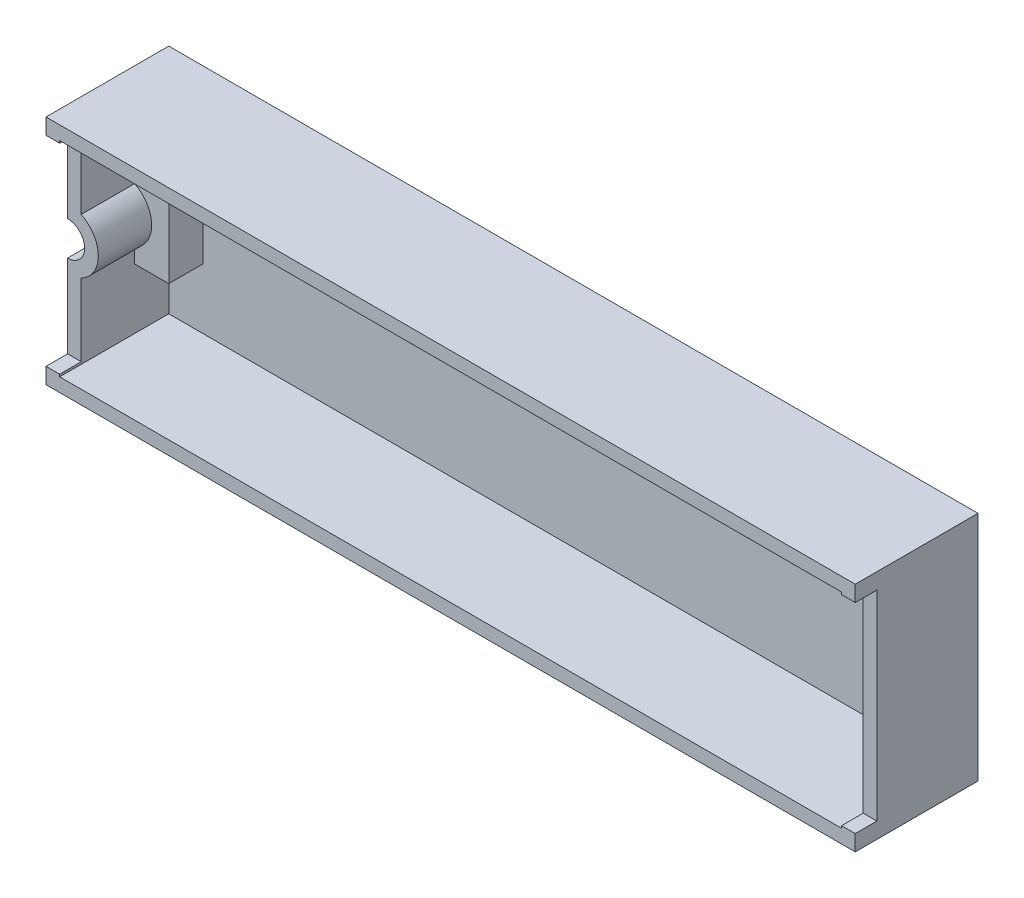
ISO-10303-21;
HEADER;
FILE_DESCRIPTION(('STEP AP214'),'2;1');
FILE_NAME('part.step','',(''),(''),'','','');
FILE_SCHEMA(('AUTOMOTIVE_DESIGN { 1 0 10303 214 1 1 1 1 }'));
ENDSEC;
DATA;
#1=APPLICATION_CONTEXT('core data for automotive mechanical design processes');
#2=APPLICATION_PROTOCOL_DEFINITION('international standard','automotive_design',2000,#1);
#3=PRODUCT_CONTEXT('',#1,'mechanical');
#4=PRODUCT('Part','Part','',(#3));
#5=PRODUCT_RELATED_PRODUCT_CATEGORY('part','',(#4));
#6=PRODUCT_DEFINITION_FORMATION('','',#4);
#7=PRODUCT_DEFINITION_CONTEXT('part definition',#1,'design');
#8=PRODUCT_DEFINITION('design','',#6,#7);
#9=PRODUCT_DEFINITION_SHAPE('','',#8);
#10=(LENGTH_UNIT() NAMED_UNIT(*) SI_UNIT(.MILLI.,.METRE.));
#11=(NAMED_UNIT(*) PLANE_ANGLE_UNIT() SI_UNIT($,.RADIAN.));
#12=(NAMED_UNIT(*) SI_UNIT($,.STERADIAN.) SOLID_ANGLE_UNIT());
#13=UNCERTAINTY_MEASURE_WITH_UNIT(LENGTH_MEASURE(1.E-05),#10,'distance_accuracy_value','');
#14=(GEOMETRIC_REPRESENTATION_CONTEXT(3) GLOBAL_UNCERTAINTY_ASSIGNED_CONTEXT((#13)) GLOBAL_UNIT_ASSIGNED_CONTEXT((#10,
#11,#12)) REPRESENTATION_CONTEXT('',''));
#15=CARTESIAN_POINT('',(0.,0.,0.));
#16=DIRECTION('',(0.,0.,1.));
#17=DIRECTION('',(1.,0.,0.));
#18=AXIS2_PLACEMENT_3D('',#15,#16,#17);
#19=CARTESIAN_POINT('',(-15.7,-1.25,0.));
#20=DIRECTION('',(1.,0.,0.));
#21=DIRECTION('',(0.,0.,-1.));
#22=AXIS2_PLACEMENT_3D('',#19,#20,#21);
#23=PLANE('',#22);
#24=DIRECTION('',(0.,1.,0.));
#25=VECTOR('',#24,1.);
#26=CARTESIAN_POINT('',(-15.7,0.,2.1));
#27=LINE('',#26,#25);
#28=CARTESIAN_POINT('',(-15.7,-1.85,2.1));
#29=VERTEX_POINT('',#28);
#30=CARTESIAN_POINT('',(-15.7,1.85,2.1));
#31=VERTEX_POINT('',#30);
#32=EDGE_CURVE('E269',#29,#31,#27,.T.);
#33=ORIENTED_EDGE('',*,*,#32,.F.);
#34=DIRECTION('',(0.,0.,-1.));
#35=VECTOR('',#34,1.);
#36=CARTESIAN_POINT('',(-15.7,-1.85,0.));
#37=LINE('',#36,#35);
#38=CARTESIAN_POINT('',(-15.7,-1.85,0.6));
#39=VERTEX_POINT('',#38);
#40=EDGE_CURVE('E272',#39,#29,#37,.F.);
#41=ORIENTED_EDGE('',*,*,#40,.F.);
#42=DIRECTION('',(0.,1.,0.));
#43=VECTOR('',#42,1.);
#44=CARTESIAN_POINT('',(-15.7,0.,0.6));
#45=LINE('',#44,#43);
#46=CARTESIAN_POINT('',(-15.7,1.85,0.6));
#47=VERTEX_POINT('',#46);
#48=EDGE_CURVE('E266',#47,#39,#45,.F.);
#49=ORIENTED_EDGE('',*,*,#48,.F.);
#50=DIRECTION('',(0.,0.,1.));
#51=VECTOR('',#50,1.);
#52=CARTESIAN_POINT('',(-15.7,1.85,0.));
#53=LINE('',#52,#51);
#54=EDGE_CURVE('E270',#31,#47,#53,.F.);
#55=ORIENTED_EDGE('',*,*,#54,.F.);
#56=EDGE_LOOP('',(#33,#41,#49,#55));
#57=FACE_BOUND('',#56,.T.);
#58=ADVANCED_FACE('F16',(#57),#23,.T.);
#59=CARTESIAN_POINT('',(-16.3,1.85,0.));
#60=DIRECTION('',(0.,1.,0.));
#61=DIRECTION('',(0.,0.,1.));
#62=AXIS2_PLACEMENT_3D('',#59,#60,#61);
#63=PLANE('',#62);
#64=DIRECTION('',(1.,0.,0.));
#65=VECTOR('',#64,1.);
#66=CARTESIAN_POINT('',(-17.05,1.85,2.1));
#67=LINE('',#66,#65);
#68=CARTESIAN_POINT('',(-17.2,1.85,2.1));
#69=VERTEX_POINT('',#68);
#70=EDGE_CURVE('E214',#31,#69,#67,.F.);
#71=ORIENTED_EDGE('',*,*,#70,.F.);
#72=ORIENTED_EDGE('',*,*,#54,.T.);
#73=DIRECTION('',(1.,0.,0.));
#74=VECTOR('',#73,1.);
#75=CARTESIAN_POINT('',(-0.042575970452277,1.85,0.6));
#76=LINE('',#75,#74);
#77=CARTESIAN_POINT('',(-17.2,1.85,0.6));
#78=VERTEX_POINT('',#77);
#79=EDGE_CURVE('E277',#78,#47,#76,.T.);
#80=ORIENTED_EDGE('',*,*,#79,.F.);
#81=DIRECTION('',(0.,0.,1.));
#82=VECTOR('',#81,1.);
#83=CARTESIAN_POINT('',(-17.2,1.85,0.));
#84=LINE('',#83,#82);
#85=EDGE_CURVE('E218',#78,#69,#84,.T.);
#86=ORIENTED_EDGE('',*,*,#85,.T.);
#87=EDGE_LOOP('',(#71,#72,#80,#86));
#88=FACE_BOUND('',#87,.T.);
#89=ADVANCED_FACE('F547',(#88),#63,.T.);
#90=CARTESIAN_POINT('',(-17.05,0.,2.1));
#91=DIRECTION('',(0.,0.,1.));
#92=DIRECTION('',(1.,0.,0.));
#93=AXIS2_PLACEMENT_3D('',#90,#91,#92);
#94=PLANE('',#93);
#95=ORIENTED_EDGE('',*,*,#70,.T.);
#96=DIRECTION('',(0.,1.,0.));
#97=VECTOR('',#96,1.);
#98=CARTESIAN_POINT('',(-17.2,5.1,2.1));
#99=LINE('',#98,#97);
#100=CARTESIAN_POINT('',(-17.2,1.20933866224478,2.1));
#101=VERTEX_POINT('',#100);
#102=EDGE_CURVE('E210',#69,#101,#99,.F.);
#103=ORIENTED_EDGE('',*,*,#102,.T.);
#104=CARTESIAN_POINT('',(-17.8,0.,2.1));
#105=DIRECTION('',(0.,0.,1.));
#106=DIRECTION('',(1.,0.,0.));
#107=AXIS2_PLACEMENT_3D('',#104,#105,#106);
#108=CIRCLE('',#107,1.35);
#109=CARTESIAN_POINT('',(-17.2,-1.20933866224478,2.1));
#110=VERTEX_POINT('',#109);
#111=EDGE_CURVE('E19',#110,#101,#108,.T.);
#112=ORIENTED_EDGE('',*,*,#111,.F.);
#113=DIRECTION('',(0.,1.,0.));
#114=VECTOR('',#113,1.);
#115=CARTESIAN_POINT('',(-17.2,0.,2.1));
#116=LINE('',#115,#114);
#117=CARTESIAN_POINT('',(-17.2,-1.85,2.1));
#118=VERTEX_POINT('',#117);
#119=EDGE_CURVE('E197',#110,#118,#116,.F.);
#120=ORIENTED_EDGE('',*,*,#119,.T.);
#121=DIRECTION('',(1.,0.,0.));
#122=VECTOR('',#121,1.);
#123=CARTESIAN_POINT('',(-17.8,-1.85,2.1));
#124=LINE('',#123,#122);
#125=EDGE_CURVE('E280',#29,#118,#124,.F.);
#126=ORIENTED_EDGE('',*,*,#125,.F.);
#127=ORIENTED_EDGE('',*,*,#32,.T.);
#128=EDGE_LOOP('',(#95,#103,#112,#120,#126,#127));
#129=FACE_BOUND('',#128,.T.);
#130=ADVANCED_FACE('F212',(#129),#94,.T.);
#131=CARTESIAN_POINT('',(-17.8,-1.85,0.));
#132=DIRECTION('',(0.,-1.,0.));
#133=DIRECTION('',(0.,0.,-1.));
#134=AXIS2_PLACEMENT_3D('',#131,#132,#133);
#135=PLANE('',#134);
#136=ORIENTED_EDGE('',*,*,#125,.T.);
#137=DIRECTION('',(0.,0.,1.));
#138=VECTOR('',#137,1.);
#139=CARTESIAN_POINT('',(-17.2,-1.85,0.));
#140=LINE('',#139,#138);
#141=CARTESIAN_POINT('',(-17.2,-1.85,0.6));
#142=VERTEX_POINT('',#141);
#143=EDGE_CURVE('E225',#118,#142,#140,.F.);
#144=ORIENTED_EDGE('',*,*,#143,.T.);
#145=DIRECTION('',(1.,0.,0.));
#146=VECTOR('',#145,1.);
#147=CARTESIAN_POINT('',(-0.042575970452277,-1.85,0.6));
#148=LINE('',#147,#146);
#149=EDGE_CURVE('E264',#39,#142,#148,.F.);
#150=ORIENTED_EDGE('',*,*,#149,.F.);
#151=ORIENTED_EDGE('',*,*,#40,.T.);
#152=EDGE_LOOP('',(#136,#144,#150,#151));
#153=FACE_BOUND('',#152,.T.);
#154=ADVANCED_FACE('F541',(#153),#135,.T.);
#155=CARTESIAN_POINT('',(-0.042575970452277,0.,0.6));
#156=DIRECTION('',(0.,0.,1.));
#157=DIRECTION('',(1.,0.,0.));
#158=AXIS2_PLACEMENT_3D('',#155,#156,#157);
#159=PLANE('',#158);
#160=DIRECTION('',(1.,0.,0.));
#161=VECTOR('',#160,1.);
#162=CARTESIAN_POINT('',(17.8,4.5,0.6));
#163=LINE('',#162,#161);
#164=CARTESIAN_POINT('',(17.2,4.5,0.6));
#165=VERTEX_POINT('',#164);
#166=CARTESIAN_POINT('',(-17.2,4.5,0.6));
#167=VERTEX_POINT('',#166);
#168=EDGE_CURVE('E232',#165,#167,#163,.F.);
#169=ORIENTED_EDGE('',*,*,#168,.T.);
#170=DIRECTION('',(0.,1.,0.));
#171=VECTOR('',#170,1.);
#172=CARTESIAN_POINT('',(-17.2,5.1,0.6));
#173=LINE('',#172,#171);
#174=EDGE_CURVE('E274',#167,#78,#173,.F.);
#175=ORIENTED_EDGE('',*,*,#174,.T.);
#176=ORIENTED_EDGE('',*,*,#79,.T.);
#177=ORIENTED_EDGE('',*,*,#48,.T.);
#178=ORIENTED_EDGE('',*,*,#149,.T.);
#179=DIRECTION('',(0.,1.,0.));
#180=VECTOR('',#179,1.);
#181=CARTESIAN_POINT('',(-17.2,-0.75,0.6));
#182=LINE('',#181,#180);
#183=CARTESIAN_POINT('',(-17.2,-4.5,0.6));
#184=VERTEX_POINT('',#183);
#185=EDGE_CURVE('E322',#142,#184,#182,.F.);
#186=ORIENTED_EDGE('',*,*,#185,.T.);
#187=DIRECTION('',(1.,0.,0.));
#188=VECTOR('',#187,1.);
#189=CARTESIAN_POINT('',(-17.8,-4.5,0.6));
#190=LINE('',#189,#188);
#191=CARTESIAN_POINT('',(17.2,-4.5,0.6));
#192=VERTEX_POINT('',#191);
#193=EDGE_CURVE('E265',#184,#192,#190,.T.);
#194=ORIENTED_EDGE('',*,*,#193,.T.);
#195=DIRECTION('',(0.,1.,0.));
#196=VECTOR('',#195,1.);
#197=CARTESIAN_POINT('',(17.2,-5.1,0.6));
#198=LINE('',#197,#196);
#199=EDGE_CURVE('E301',#192,#165,#198,.T.);
#200=ORIENTED_EDGE('',*,*,#199,.T.);
#201=EDGE_LOOP('',(#169,#175,#176,#177,#178,#186,#194,#200));
#202=FACE_BOUND('',#201,.T.);
#203=ADVANCED_FACE('F537',(#202),#159,.T.);
#204=CARTESIAN_POINT('',(-17.8,-4.5,0.));
#205=DIRECTION('',(0.,-1.,0.));
#206=DIRECTION('',(0.,0.,-1.));
#207=AXIS2_PLACEMENT_3D('',#204,#205,#206);
#208=PLANE('',#207);
#209=DIRECTION('',(0.,0.,1.));
#210=VECTOR('',#209,1.);
#211=CARTESIAN_POINT('',(-17.2,-4.5,0.));
#212=LINE('',#211,#210);
#213=CARTESIAN_POINT('',(-17.2,-4.5,5.4));
#214=VERTEX_POINT('',#213);
#215=EDGE_CURVE('E319',#184,#214,#212,.T.);
#216=ORIENTED_EDGE('',*,*,#215,.T.);
#217=DIRECTION('',(1.,0.,0.));
#218=VECTOR('',#217,1.);
#219=CARTESIAN_POINT('',(-0.042575970452277,-4.5,5.4));
#220=LINE('',#219,#218);
#221=CARTESIAN_POINT('',(17.2,-4.5,5.4));
#222=VERTEX_POINT('',#221);
#223=EDGE_CURVE('E241',#222,#214,#220,.F.);
#224=ORIENTED_EDGE('',*,*,#223,.F.);
#225=DIRECTION('',(0.,0.,-1.));
#226=VECTOR('',#225,1.);
#227=CARTESIAN_POINT('',(17.2,-4.5,0.));
#228=LINE('',#227,#226);
#229=EDGE_CURVE('E303',#222,#192,#228,.T.);
#230=ORIENTED_EDGE('',*,*,#229,.T.);
#231=ORIENTED_EDGE('',*,*,#193,.F.);
#232=EDGE_LOOP('',(#216,#224,#230,#231));
#233=FACE_BOUND('',#232,.T.);
#234=ADVANCED_FACE('F533',(#233),#208,.F.);
#235=CARTESIAN_POINT('',(17.2,-5.1,0.));
#236=DIRECTION('',(1.,0.,0.));
#237=DIRECTION('',(0.,0.,-1.));
#238=AXIS2_PLACEMENT_3D('',#235,#236,#237);
#239=PLANE('',#238);
#240=DIRECTION('',(0.,1.,0.));
#241=VECTOR('',#240,1.);
#242=CARTESIAN_POINT('',(17.2,-4.4,4.45));
#243=LINE('',#242,#241);
#244=CARTESIAN_POINT('',(17.2,-4.4,4.45));
#245=VERTEX_POINT('',#244);
#246=CARTESIAN_POINT('',(17.2,4.4,4.45));
#247=VERTEX_POINT('',#246);
#248=EDGE_CURVE('E312',#245,#247,#243,.T.);
#249=ORIENTED_EDGE('',*,*,#248,.T.);
#250=DIRECTION('',(0.,0.,1.));
#251=VECTOR('',#250,1.);
#252=CARTESIAN_POINT('',(17.2,4.4,4.45));
#253=LINE('',#252,#251);
#254=CARTESIAN_POINT('',(17.2,4.4,5.4));
#255=VERTEX_POINT('',#254);
#256=EDGE_CURVE('E305',#247,#255,#253,.T.);
#257=ORIENTED_EDGE('',*,*,#256,.T.);
#258=DIRECTION('',(0.,1.,0.));
#259=VECTOR('',#258,1.);
#260=CARTESIAN_POINT('',(17.2,-5.1,5.4));
#261=LINE('',#260,#259);
#262=CARTESIAN_POINT('',(17.2,4.5,5.4));
#263=VERTEX_POINT('',#262);
#264=EDGE_CURVE('E300',#263,#255,#261,.F.);
#265=ORIENTED_EDGE('',*,*,#264,.F.);
#266=DIRECTION('',(0.,0.,1.));
#267=VECTOR('',#266,1.);
#268=CARTESIAN_POINT('',(17.2,4.5,0.));
#269=LINE('',#268,#267);
#270=EDGE_CURVE('E284',#263,#165,#269,.F.);
#271=ORIENTED_EDGE('',*,*,#270,.T.);
#272=ORIENTED_EDGE('',*,*,#199,.F.);
#273=ORIENTED_EDGE('',*,*,#229,.F.);
#274=DIRECTION('',(0.,1.,0.));
#275=VECTOR('',#274,1.);
#276=CARTESIAN_POINT('',(17.2,0.,5.4));
#277=LINE('',#276,#275);
#278=CARTESIAN_POINT('',(17.2,-4.4,5.4));
#279=VERTEX_POINT('',#278);
#280=EDGE_CURVE('E236',#279,#222,#277,.F.);
#281=ORIENTED_EDGE('',*,*,#280,.F.);
#282=DIRECTION('',(0.,0.,-1.));
#283=VECTOR('',#282,1.);
#284=CARTESIAN_POINT('',(17.2,-4.4,5.4));
#285=LINE('',#284,#283);
#286=EDGE_CURVE('E309',#279,#245,#285,.T.);
#287=ORIENTED_EDGE('',*,*,#286,.T.);
#288=EDGE_LOOP('',(#249,#257,#265,#271,#272,#273,#281,#287));
#289=FACE_BOUND('',#288,.T.);
#290=ADVANCED_FACE('F529',(#289),#239,.F.);
#291=CARTESIAN_POINT('',(17.8,4.5,0.));
#292=DIRECTION('',(0.,1.,0.));
#293=DIRECTION('',(0.,0.,1.));
#294=AXIS2_PLACEMENT_3D('',#291,#292,#293);
#295=PLANE('',#294);
#296=ORIENTED_EDGE('',*,*,#270,.F.);
#297=DIRECTION('',(1.,0.,0.));
#298=VECTOR('',#297,1.);
#299=CARTESIAN_POINT('',(-0.042575970452277,4.5,5.4));
#300=LINE('',#299,#298);
#301=CARTESIAN_POINT('',(-17.2,4.5,5.4));
#302=VERTEX_POINT('',#301);
#303=EDGE_CURVE('E288',#302,#263,#300,.T.);
#304=ORIENTED_EDGE('',*,*,#303,.F.);
#305=DIRECTION('',(0.,0.,1.));
#306=VECTOR('',#305,1.);
#307=CARTESIAN_POINT('',(-17.2,4.5,0.));
#308=LINE('',#307,#306);
#309=EDGE_CURVE('E231',#302,#167,#308,.F.);
#310=ORIENTED_EDGE('',*,*,#309,.T.);
#311=ORIENTED_EDGE('',*,*,#168,.F.);
#312=EDGE_LOOP('',(#296,#304,#310,#311));
#313=FACE_BOUND('',#312,.T.);
#314=ADVANCED_FACE('F526',(#313),#295,.F.);
#315=CARTESIAN_POINT('',(-17.2,5.1,0.));
#316=DIRECTION('',(-1.,0.,0.));
#317=DIRECTION('',(0.,0.,1.));
#318=AXIS2_PLACEMENT_3D('',#315,#316,#317);
#319=PLANE('',#318);
#320=DIRECTION('',(0.,0.,1.));
#321=VECTOR('',#320,1.);
#322=CARTESIAN_POINT('',(-17.2,1.20933866224478,0.));
#323=LINE('',#322,#321);
#324=CARTESIAN_POINT('',(-17.2,1.20933866224478,4.45));
#325=VERTEX_POINT('',#324);
#326=EDGE_CURVE('E206',#101,#325,#323,.T.);
#327=ORIENTED_EDGE('',*,*,#326,.F.);
#328=ORIENTED_EDGE('',*,*,#102,.F.);
#329=ORIENTED_EDGE('',*,*,#85,.F.);
#330=ORIENTED_EDGE('',*,*,#174,.F.);
#331=ORIENTED_EDGE('',*,*,#309,.F.);
#332=DIRECTION('',(0.,1.,0.));
#333=VECTOR('',#332,1.);
#334=CARTESIAN_POINT('',(-17.2,0.,5.4));
#335=LINE('',#334,#333);
#336=CARTESIAN_POINT('',(-17.2,4.4,5.4));
#337=VERTEX_POINT('',#336);
#338=EDGE_CURVE('E285',#337,#302,#335,.T.);
#339=ORIENTED_EDGE('',*,*,#338,.F.);
#340=DIRECTION('',(0.,0.,1.));
#341=VECTOR('',#340,1.);
#342=CARTESIAN_POINT('',(-17.2,4.4,0.));
#343=LINE('',#342,#341);
#344=CARTESIAN_POINT('',(-17.2,4.4,4.45));
#345=VERTEX_POINT('',#344);
#346=EDGE_CURVE('E229',#345,#337,#343,.T.);
#347=ORIENTED_EDGE('',*,*,#346,.F.);
#348=DIRECTION('',(0.,1.,0.));
#349=VECTOR('',#348,1.);
#350=CARTESIAN_POINT('',(-17.2,-4.4,4.45));
#351=LINE('',#350,#349);
#352=EDGE_CURVE('E223',#345,#325,#351,.F.);
#353=ORIENTED_EDGE('',*,*,#352,.T.);
#354=EDGE_LOOP('',(#327,#328,#329,#330,#331,#339,#347,#353));
#355=FACE_BOUND('',#354,.T.);
#356=ADVANCED_FACE('F221',(#355),#319,.F.);
#357=CARTESIAN_POINT('',(-17.8,0.,0.));
#358=DIRECTION('',(0.,0.,1.));
#359=DIRECTION('',(1.,0.,0.));
#360=AXIS2_PLACEMENT_3D('',#357,#358,#359);
#361=CYLINDRICAL_SURFACE('',#360,1.35);
#362=ORIENTED_EDGE('',*,*,#111,.T.);
#363=ORIENTED_EDGE('',*,*,#326,.T.);
#364=CARTESIAN_POINT('',(-17.8,0.,4.45));
#365=DIRECTION('',(0.,0.,1.));
#366=DIRECTION('',(1.,0.,0.));
#367=AXIS2_PLACEMENT_3D('',#364,#365,#366);
#368=CIRCLE('',#367,1.35);
#369=CARTESIAN_POINT('',(-17.2,-1.20933866224478,4.45));
#370=VERTEX_POINT('',#369);
#371=EDGE_CURVE('E336',#325,#370,#368,.F.);
#372=ORIENTED_EDGE('',*,*,#371,.T.);
#373=DIRECTION('',(0.,0.,1.));
#374=VECTOR('',#373,1.);
#375=CARTESIAN_POINT('',(-17.2,-1.20933866224478,0.));
#376=LINE('',#375,#374);
#377=EDGE_CURVE('E208',#370,#110,#376,.F.);
#378=ORIENTED_EDGE('',*,*,#377,.T.);
#379=EDGE_LOOP('',(#362,#363,#372,#378));
#380=FACE_BOUND('',#379,.T.);
#381=ADVANCED_FACE('F203',(#380),#361,.T.);
#382=CARTESIAN_POINT('',(-17.2,-0.75,0.));
#383=DIRECTION('',(-1.,0.,0.));
#384=DIRECTION('',(0.,0.,1.));
#385=AXIS2_PLACEMENT_3D('',#382,#383,#384);
#386=PLANE('',#385);
#387=DIRECTION('',(0.,0.,-1.));
#388=VECTOR('',#387,1.);
#389=CARTESIAN_POINT('',(-17.2,-4.4,5.4));
#390=LINE('',#389,#388);
#391=CARTESIAN_POINT('',(-17.2,-4.4,4.45));
#392=VERTEX_POINT('',#391);
#393=CARTESIAN_POINT('',(-17.2,-4.4,5.4));
#394=VERTEX_POINT('',#393);
#395=EDGE_CURVE('E233',#392,#394,#390,.F.);
#396=ORIENTED_EDGE('',*,*,#395,.T.);
#397=DIRECTION('',(0.,1.,0.));
#398=VECTOR('',#397,1.);
#399=CARTESIAN_POINT('',(-17.2,0.,5.4));
#400=LINE('',#399,#398);
#401=EDGE_CURVE('E238',#214,#394,#400,.T.);
#402=ORIENTED_EDGE('',*,*,#401,.F.);
#403=ORIENTED_EDGE('',*,*,#215,.F.);
#404=ORIENTED_EDGE('',*,*,#185,.F.);
#405=ORIENTED_EDGE('',*,*,#143,.F.);
#406=ORIENTED_EDGE('',*,*,#119,.F.);
#407=ORIENTED_EDGE('',*,*,#377,.F.);
#408=DIRECTION('',(0.,1.,0.));
#409=VECTOR('',#408,1.);
#410=CARTESIAN_POINT('',(-17.2,-4.4,4.45));
#411=LINE('',#410,#409);
#412=EDGE_CURVE('E337',#370,#392,#411,.F.);
#413=ORIENTED_EDGE('',*,*,#412,.T.);
#414=EDGE_LOOP('',(#396,#402,#403,#404,#405,#406,#407,#413));
#415=FACE_BOUND('',#414,.T.);
#416=ADVANCED_FACE('F519',(#415),#386,.F.);
#417=CARTESIAN_POINT('',(-17.05,0.,1.5));
#418=DIRECTION('',(0.,0.,1.));
#419=DIRECTION('',(1.,0.,0.));
#420=AXIS2_PLACEMENT_3D('',#417,#418,#419);
#421=PLANE('',#420);
#422=DIRECTION('',(0.,1.,0.));
#423=VECTOR('',#422,1.);
#424=CARTESIAN_POINT('',(-17.8,0.,1.5));
#425=LINE('',#424,#423);
#426=CARTESIAN_POINT('',(-17.8,1.25,1.5));
#427=VERTEX_POINT('',#426);
#428=CARTESIAN_POINT('',(-17.8,0.75,1.5));
#429=VERTEX_POINT('',#428);
#430=EDGE_CURVE('E237',#427,#429,#425,.F.);
#431=ORIENTED_EDGE('',*,*,#430,.F.);
#432=DIRECTION('',(1.,0.,0.));
#433=VECTOR('',#432,1.);
#434=CARTESIAN_POINT('',(-17.05,1.25,1.5));
#435=LINE('',#434,#433);
#436=CARTESIAN_POINT('',(-16.3,1.25,1.5));
#437=VERTEX_POINT('',#436);
#438=EDGE_CURVE('E247',#437,#427,#435,.F.);
#439=ORIENTED_EDGE('',*,*,#438,.F.);
#440=DIRECTION('',(0.,1.,0.));
#441=VECTOR('',#440,1.);
#442=CARTESIAN_POINT('',(-16.3,-1.25,1.5));
#443=LINE('',#442,#441);
#444=CARTESIAN_POINT('',(-16.3,-1.25,1.5));
#445=VERTEX_POINT('',#444);
#446=EDGE_CURVE('E250',#437,#445,#443,.F.);
#447=ORIENTED_EDGE('',*,*,#446,.T.);
#448=DIRECTION('',(1.,0.,0.));
#449=VECTOR('',#448,1.);
#450=CARTESIAN_POINT('',(-17.05,-1.25,1.5));
#451=LINE('',#450,#449);
#452=CARTESIAN_POINT('',(-17.8,-1.25,1.5));
#453=VERTEX_POINT('',#452);
#454=EDGE_CURVE('E249',#453,#445,#451,.T.);
#455=ORIENTED_EDGE('',*,*,#454,.F.);
#456=DIRECTION('',(0.,1.,0.));
#457=VECTOR('',#456,1.);
#458=CARTESIAN_POINT('',(-17.8,0.,1.5));
#459=LINE('',#458,#457);
#460=CARTESIAN_POINT('',(-17.8,-0.75,1.5));
#461=VERTEX_POINT('',#460);
#462=EDGE_CURVE('E259',#461,#453,#459,.F.);
#463=ORIENTED_EDGE('',*,*,#462,.F.);
#464=CARTESIAN_POINT('',(-17.8,0.,1.5));
#465=DIRECTION('',(0.,0.,1.));
#466=DIRECTION('',(1.,0.,0.));
#467=AXIS2_PLACEMENT_3D('',#464,#465,#466);
#468=CIRCLE('',#467,0.75);
#469=EDGE_CURVE('E296',#461,#429,#468,.T.);
#470=ORIENTED_EDGE('',*,*,#469,.T.);
#471=EDGE_LOOP('',(#431,#439,#447,#455,#463,#470));
#472=FACE_BOUND('',#471,.T.);
#473=ADVANCED_FACE('F386',(#472),#421,.F.);
#474=CARTESIAN_POINT('',(-17.8,-4.4,5.4));
#475=DIRECTION('',(0.,-1.,0.));
#476=DIRECTION('',(0.,0.,-1.));
#477=AXIS2_PLACEMENT_3D('',#474,#475,#476);
#478=PLANE('',#477);
#479=DIRECTION('',(-1.,0.,0.));
#480=VECTOR('',#479,1.);
#481=CARTESIAN_POINT('',(-17.8,-4.4,4.45));
#482=LINE('',#481,#480);
#483=CARTESIAN_POINT('',(-17.8,-4.4,4.45));
#484=VERTEX_POINT('',#483);
#485=EDGE_CURVE('E292',#392,#484,#482,.T.);
#486=ORIENTED_EDGE('',*,*,#485,.T.);
#487=DIRECTION('',(0.,0.,1.));
#488=VECTOR('',#487,1.);
#489=CARTESIAN_POINT('',(-17.8,-4.4,0.));
#490=LINE('',#489,#488);
#491=CARTESIAN_POINT('',(-17.8,-4.4,5.4));
#492=VERTEX_POINT('',#491);
#493=EDGE_CURVE('E372',#492,#484,#490,.F.);
#494=ORIENTED_EDGE('',*,*,#493,.F.);
#495=DIRECTION('',(1.,0.,0.));
#496=VECTOR('',#495,1.);
#497=CARTESIAN_POINT('',(-0.042575970452277,-4.4,5.4));
#498=LINE('',#497,#496);
#499=EDGE_CURVE('E240',#394,#492,#498,.F.);
#500=ORIENTED_EDGE('',*,*,#499,.F.);
#501=ORIENTED_EDGE('',*,*,#395,.F.);
#502=EDGE_LOOP('',(#486,#494,#500,#501));
#503=FACE_BOUND('',#502,.T.);
#504=ADVANCED_FACE('F512',(#503),#478,.F.);
#505=CARTESIAN_POINT('',(-0.042575970452277,0.,5.4));
#506=DIRECTION('',(0.,0.,1.));
#507=DIRECTION('',(1.,0.,0.));
#508=AXIS2_PLACEMENT_3D('',#505,#506,#507);
#509=PLANE('',#508);
#510=DIRECTION('',(1.,0.,0.));
#511=VECTOR('',#510,1.);
#512=CARTESIAN_POINT('',(-17.8,-5.1,5.4));
#513=LINE('',#512,#511);
#514=CARTESIAN_POINT('',(17.8,-5.1,5.4));
#515=VERTEX_POINT('',#514);
#516=CARTESIAN_POINT('',(-17.8,-5.1,5.4));
#517=VERTEX_POINT('',#516);
#518=EDGE_CURVE('E375',#515,#517,#513,.F.);
#519=ORIENTED_EDGE('',*,*,#518,.F.);
#520=DIRECTION('',(0.,1.,0.));
#521=VECTOR('',#520,1.);
#522=CARTESIAN_POINT('',(17.8,0.,5.4));
#523=LINE('',#522,#521);
#524=CARTESIAN_POINT('',(17.8,-4.4,5.4));
#525=VERTEX_POINT('',#524);
#526=EDGE_CURVE('E243',#515,#525,#523,.T.);
#527=ORIENTED_EDGE('',*,*,#526,.T.);
#528=DIRECTION('',(1.,0.,0.));
#529=VECTOR('',#528,1.);
#530=CARTESIAN_POINT('',(-17.8,-4.4,5.4));
#531=LINE('',#530,#529);
#532=EDGE_CURVE('E364',#525,#279,#531,.F.);
#533=ORIENTED_EDGE('',*,*,#532,.T.);
#534=ORIENTED_EDGE('',*,*,#280,.T.);
#535=ORIENTED_EDGE('',*,*,#223,.T.);
#536=ORIENTED_EDGE('',*,*,#401,.T.);
#537=ORIENTED_EDGE('',*,*,#499,.T.);
#538=DIRECTION('',(0.,1.,0.));
#539=VECTOR('',#538,1.);
#540=CARTESIAN_POINT('',(-17.8,-0.75,5.4));
#541=LINE('',#540,#539);
#542=EDGE_CURVE('E262',#517,#492,#541,.T.);
#543=ORIENTED_EDGE('',*,*,#542,.F.);
#544=EDGE_LOOP('',(#519,#527,#533,#534,#535,#536,#537,#543));
#545=FACE_BOUND('',#544,.T.);
#546=ADVANCED_FACE('F508',(#545),#509,.T.);
#547=CARTESIAN_POINT('',(-17.8,-4.4,5.4));
#548=DIRECTION('',(0.,-1.,0.));
#549=DIRECTION('',(0.,0.,-1.));
#550=AXIS2_PLACEMENT_3D('',#547,#548,#549);
#551=PLANE('',#550);
#552=ORIENTED_EDGE('',*,*,#532,.F.);
#553=DIRECTION('',(0.,0.,-1.));
#554=VECTOR('',#553,1.);
#555=CARTESIAN_POINT('',(17.8,-4.4,0.));
#556=LINE('',#555,#554);
#557=CARTESIAN_POINT('',(17.8,-4.4,4.45));
#558=VERTEX_POINT('',#557);
#559=EDGE_CURVE('E431',#558,#525,#556,.F.);
#560=ORIENTED_EDGE('',*,*,#559,.F.);
#561=DIRECTION('',(-1.,0.,0.));
#562=VECTOR('',#561,1.);
#563=CARTESIAN_POINT('',(-17.8,-4.4,4.45));
#564=LINE('',#563,#562);
#565=EDGE_CURVE('E358',#558,#245,#564,.T.);
#566=ORIENTED_EDGE('',*,*,#565,.T.);
#567=ORIENTED_EDGE('',*,*,#286,.F.);
#568=EDGE_LOOP('',(#552,#560,#566,#567));
#569=FACE_BOUND('',#568,.T.);
#570=ADVANCED_FACE('F504',(#569),#551,.F.);
#571=CARTESIAN_POINT('',(-17.8,4.4,4.45));
#572=DIRECTION('',(0.,1.,0.));
#573=DIRECTION('',(0.,0.,1.));
#574=AXIS2_PLACEMENT_3D('',#571,#572,#573);
#575=PLANE('',#574);
#576=DIRECTION('',(-1.,0.,0.));
#577=VECTOR('',#576,1.);
#578=CARTESIAN_POINT('',(-17.8,4.4,4.45));
#579=LINE('',#578,#577);
#580=CARTESIAN_POINT('',(17.8,4.4,4.45));
#581=VERTEX_POINT('',#580);
#582=EDGE_CURVE('E308',#247,#581,#579,.F.);
#583=ORIENTED_EDGE('',*,*,#582,.T.);
#584=DIRECTION('',(0.,0.,-1.));
#585=VECTOR('',#584,1.);
#586=CARTESIAN_POINT('',(17.8,4.4,0.));
#587=LINE('',#586,#585);
#588=CARTESIAN_POINT('',(17.8,4.4,5.4));
#589=VERTEX_POINT('',#588);
#590=EDGE_CURVE('E426',#589,#581,#587,.T.);
#591=ORIENTED_EDGE('',*,*,#590,.F.);
#592=DIRECTION('',(1.,0.,0.));
#593=VECTOR('',#592,1.);
#594=CARTESIAN_POINT('',(-0.042575970452277,4.4,5.4));
#595=LINE('',#594,#593);
#596=EDGE_CURVE('E310',#255,#589,#595,.T.);
#597=ORIENTED_EDGE('',*,*,#596,.F.);
#598=ORIENTED_EDGE('',*,*,#256,.F.);
#599=EDGE_LOOP('',(#583,#591,#597,#598));
#600=FACE_BOUND('',#599,.T.);
#601=ADVANCED_FACE('F500',(#600),#575,.F.);
#602=CARTESIAN_POINT('',(-17.8,-4.4,4.45));
#603=DIRECTION('',(0.,0.,-1.));
#604=DIRECTION('',(-1.,0.,0.));
#605=AXIS2_PLACEMENT_3D('',#602,#603,#604);
#606=PLANE('',#605);
#607=ORIENTED_EDGE('',*,*,#565,.F.);
#608=DIRECTION('',(0.,1.,0.));
#609=VECTOR('',#608,1.);
#610=CARTESIAN_POINT('',(17.8,-5.1,4.45));
#611=LINE('',#610,#609);
#612=EDGE_CURVE('E413',#581,#558,#611,.F.);
#613=ORIENTED_EDGE('',*,*,#612,.F.);
#614=ORIENTED_EDGE('',*,*,#582,.F.);
#615=ORIENTED_EDGE('',*,*,#248,.F.);
#616=EDGE_LOOP('',(#607,#613,#614,#615));
#617=FACE_BOUND('',#616,.T.);
#618=ADVANCED_FACE('F497',(#617),#606,.F.);
#619=CARTESIAN_POINT('',(-0.042575970452277,0.,5.4));
#620=DIRECTION('',(0.,0.,1.));
#621=DIRECTION('',(1.,0.,0.));
#622=AXIS2_PLACEMENT_3D('',#619,#620,#621);
#623=PLANE('',#622);
#624=ORIENTED_EDGE('',*,*,#303,.T.);
#625=ORIENTED_EDGE('',*,*,#264,.T.);
#626=ORIENTED_EDGE('',*,*,#596,.T.);
#627=DIRECTION('',(0.,1.,0.));
#628=VECTOR('',#627,1.);
#629=CARTESIAN_POINT('',(17.8,-5.1,5.4));
#630=LINE('',#629,#628);
#631=CARTESIAN_POINT('',(17.8,5.1,5.4));
#632=VERTEX_POINT('',#631);
#633=EDGE_CURVE('E410',#632,#589,#630,.F.);
#634=ORIENTED_EDGE('',*,*,#633,.F.);
#635=DIRECTION('',(1.,0.,0.));
#636=VECTOR('',#635,1.);
#637=CARTESIAN_POINT('',(17.8,5.1,5.4));
#638=LINE('',#637,#636);
#639=CARTESIAN_POINT('',(-17.8,5.1,5.4));
#640=VERTEX_POINT('',#639);
#641=EDGE_CURVE('E407',#640,#632,#638,.T.);
#642=ORIENTED_EDGE('',*,*,#641,.F.);
#643=DIRECTION('',(0.,1.,0.));
#644=VECTOR('',#643,1.);
#645=CARTESIAN_POINT('',(-17.8,0.,5.4));
#646=LINE('',#645,#644);
#647=CARTESIAN_POINT('',(-17.8,4.4,5.4));
#648=VERTEX_POINT('',#647);
#649=EDGE_CURVE('E289',#640,#648,#646,.F.);
#650=ORIENTED_EDGE('',*,*,#649,.T.);
#651=DIRECTION('',(1.,0.,0.));
#652=VECTOR('',#651,1.);
#653=CARTESIAN_POINT('',(-17.8,4.4,5.4));
#654=LINE('',#653,#652);
#655=EDGE_CURVE('E293',#648,#337,#654,.T.);
#656=ORIENTED_EDGE('',*,*,#655,.T.);
#657=ORIENTED_EDGE('',*,*,#338,.T.);
#658=EDGE_LOOP('',(#624,#625,#626,#634,#642,#650,#656,#657));
#659=FACE_BOUND('',#658,.T.);
#660=ADVANCED_FACE('F408',(#659),#623,.T.);
#661=CARTESIAN_POINT('',(-17.8,-4.4,4.45));
#662=DIRECTION('',(0.,0.,-1.));
#663=DIRECTION('',(-1.,0.,0.));
#664=AXIS2_PLACEMENT_3D('',#661,#662,#663);
#665=PLANE('',#664);
#666=ORIENTED_EDGE('',*,*,#371,.F.);
#667=ORIENTED_EDGE('',*,*,#352,.F.);
#668=DIRECTION('',(1.,0.,0.));
#669=VECTOR('',#668,1.);
#670=CARTESIAN_POINT('',(-17.8,4.4,4.45));
#671=LINE('',#670,#669);
#672=CARTESIAN_POINT('',(-17.8,4.4,4.45));
#673=VERTEX_POINT('',#672);
#674=EDGE_CURVE('E297',#345,#673,#671,.F.);
#675=ORIENTED_EDGE('',*,*,#674,.T.);
#676=DIRECTION('',(0.,1.,0.));
#677=VECTOR('',#676,1.);
#678=CARTESIAN_POINT('',(-17.8,5.1,4.45));
#679=LINE('',#678,#677);
#680=CARTESIAN_POINT('',(-17.8,0.75,4.45));
#681=VERTEX_POINT('',#680);
#682=EDGE_CURVE('E347',#681,#673,#679,.T.);
#683=ORIENTED_EDGE('',*,*,#682,.F.);
#684=CARTESIAN_POINT('',(-17.8,0.,4.45));
#685=DIRECTION('',(0.,0.,1.));
#686=DIRECTION('',(1.,0.,0.));
#687=AXIS2_PLACEMENT_3D('',#684,#685,#686);
#688=CIRCLE('',#687,0.75);
#689=CARTESIAN_POINT('',(-17.8,-0.75,4.45));
#690=VERTEX_POINT('',#689);
#691=EDGE_CURVE('E254',#681,#690,#688,.F.);
#692=ORIENTED_EDGE('',*,*,#691,.T.);
#693=DIRECTION('',(0.,1.,0.));
#694=VECTOR('',#693,1.);
#695=CARTESIAN_POINT('',(-17.8,-0.75,4.45));
#696=LINE('',#695,#694);
#697=EDGE_CURVE('E368',#484,#690,#696,.T.);
#698=ORIENTED_EDGE('',*,*,#697,.F.);
#699=ORIENTED_EDGE('',*,*,#485,.F.);
#700=ORIENTED_EDGE('',*,*,#412,.F.);
#701=EDGE_LOOP('',(#666,#667,#675,#683,#692,#698,#699,#700));
#702=FACE_BOUND('',#701,.T.);
#703=ADVANCED_FACE('F394',(#702),#665,.F.);
#704=CARTESIAN_POINT('',(-17.8,4.4,4.45));
#705=DIRECTION('',(0.,1.,0.));
#706=DIRECTION('',(0.,0.,1.));
#707=AXIS2_PLACEMENT_3D('',#704,#705,#706);
#708=PLANE('',#707);
#709=ORIENTED_EDGE('',*,*,#655,.F.);
#710=DIRECTION('',(0.,0.,1.));
#711=VECTOR('',#710,1.);
#712=CARTESIAN_POINT('',(-17.8,4.4,0.));
#713=LINE('',#712,#711);
#714=EDGE_CURVE('E349',#673,#648,#713,.T.);
#715=ORIENTED_EDGE('',*,*,#714,.F.);
#716=ORIENTED_EDGE('',*,*,#674,.F.);
#717=ORIENTED_EDGE('',*,*,#346,.T.);
#718=EDGE_LOOP('',(#709,#715,#716,#717));
#719=FACE_BOUND('',#718,.T.);
#720=ADVANCED_FACE('F400',(#719),#708,.F.);
#721=CARTESIAN_POINT('',(-17.8,0.,0.));
#722=DIRECTION('',(0.,0.,1.));
#723=DIRECTION('',(1.,0.,0.));
#724=AXIS2_PLACEMENT_3D('',#721,#722,#723);
#725=CYLINDRICAL_SURFACE('',#724,0.75);
#726=DIRECTION('',(0.,0.,1.));
#727=VECTOR('',#726,1.);
#728=CARTESIAN_POINT('',(-17.8,0.75,0.));
#729=LINE('',#728,#727);
#730=EDGE_CURVE('E246',#429,#681,#729,.T.);
#731=ORIENTED_EDGE('',*,*,#730,.F.);
#732=ORIENTED_EDGE('',*,*,#469,.F.);
#733=DIRECTION('',(0.,0.,1.));
#734=VECTOR('',#733,1.);
#735=CARTESIAN_POINT('',(-17.8,-0.75,0.));
#736=LINE('',#735,#734);
#737=EDGE_CURVE('E263',#690,#461,#736,.F.);
#738=ORIENTED_EDGE('',*,*,#737,.F.);
#739=ORIENTED_EDGE('',*,*,#691,.F.);
#740=EDGE_LOOP('',(#731,#732,#738,#739));
#741=FACE_BOUND('',#740,.T.);
#742=ADVANCED_FACE('F389',(#741),#725,.F.);
#743=CARTESIAN_POINT('',(-16.3,-1.25,0.));
#744=DIRECTION('',(1.,0.,0.));
#745=DIRECTION('',(0.,0.,-1.));
#746=AXIS2_PLACEMENT_3D('',#743,#744,#745);
#747=PLANE('',#746);
#748=DIRECTION('',(0.,0.,-1.));
#749=VECTOR('',#748,1.);
#750=CARTESIAN_POINT('',(-16.3,-1.25,0.));
#751=LINE('',#750,#749);
#752=CARTESIAN_POINT('',(-16.3,-1.25,0.));
#753=VERTEX_POINT('',#752);
#754=EDGE_CURVE('E253',#753,#445,#751,.F.);
#755=ORIENTED_EDGE('',*,*,#754,.T.);
#756=ORIENTED_EDGE('',*,*,#446,.F.);
#757=DIRECTION('',(0.,0.,1.));
#758=VECTOR('',#757,1.);
#759=CARTESIAN_POINT('',(-16.3,1.25,0.));
#760=LINE('',#759,#758);
#761=CARTESIAN_POINT('',(-16.3,1.25,0.));
#762=VERTEX_POINT('',#761);
#763=EDGE_CURVE('E245',#437,#762,#760,.F.);
#764=ORIENTED_EDGE('',*,*,#763,.T.);
#765=DIRECTION('',(0.,1.,0.));
#766=VECTOR('',#765,1.);
#767=CARTESIAN_POINT('',(-16.3,0.,0.));
#768=LINE('',#767,#766);
#769=EDGE_CURVE('E257',#762,#753,#768,.F.);
#770=ORIENTED_EDGE('',*,*,#769,.T.);
#771=EDGE_LOOP('',(#755,#756,#764,#770));
#772=FACE_BOUND('',#771,.T.);
#773=ADVANCED_FACE('F441',(#772),#747,.F.);
#774=CARTESIAN_POINT('',(-17.8,-1.25,0.));
#775=DIRECTION('',(0.,-1.,0.));
#776=DIRECTION('',(0.,0.,-1.));
#777=AXIS2_PLACEMENT_3D('',#774,#775,#776);
#778=PLANE('',#777);
#779=DIRECTION('',(0.,0.,1.));
#780=VECTOR('',#779,1.);
#781=CARTESIAN_POINT('',(-17.8,-1.25,0.));
#782=LINE('',#781,#780);
#783=CARTESIAN_POINT('',(-17.8,-1.25,0.));
#784=VERTEX_POINT('',#783);
#785=EDGE_CURVE('E260',#453,#784,#782,.F.);
#786=ORIENTED_EDGE('',*,*,#785,.F.);
#787=ORIENTED_EDGE('',*,*,#454,.T.);
#788=ORIENTED_EDGE('',*,*,#754,.F.);
#789=DIRECTION('',(1.,0.,0.));
#790=VECTOR('',#789,1.);
#791=CARTESIAN_POINT('',(-0.042575970452277,-1.25,0.));
#792=LINE('',#791,#790);
#793=EDGE_CURVE('E447',#753,#784,#792,.F.);
#794=ORIENTED_EDGE('',*,*,#793,.T.);
#795=EDGE_LOOP('',(#786,#787,#788,#794));
#796=FACE_BOUND('',#795,.T.);
#797=ADVANCED_FACE('F446',(#796),#778,.F.);
#798=CARTESIAN_POINT('',(-17.8,-0.75,0.));
#799=DIRECTION('',(-1.,0.,0.));
#800=DIRECTION('',(0.,0.,1.));
#801=AXIS2_PLACEMENT_3D('',#798,#799,#800);
#802=PLANE('',#801);
#803=ORIENTED_EDGE('',*,*,#542,.T.);
#804=ORIENTED_EDGE('',*,*,#493,.T.);
#805=ORIENTED_EDGE('',*,*,#697,.T.);
#806=ORIENTED_EDGE('',*,*,#737,.T.);
#807=ORIENTED_EDGE('',*,*,#462,.T.);
#808=ORIENTED_EDGE('',*,*,#785,.T.);
#809=DIRECTION('',(0.,1.,0.));
#810=VECTOR('',#809,1.);
#811=CARTESIAN_POINT('',(-17.8,0.,0.));
#812=LINE('',#811,#810);
#813=CARTESIAN_POINT('',(-17.8,-5.1,0.));
#814=VERTEX_POINT('',#813);
#815=EDGE_CURVE('E451',#784,#814,#812,.F.);
#816=ORIENTED_EDGE('',*,*,#815,.T.);
#817=DIRECTION('',(0.,0.,-1.));
#818=VECTOR('',#817,1.);
#819=CARTESIAN_POINT('',(-17.8,-5.1,0.));
#820=LINE('',#819,#818);
#821=EDGE_CURVE('E434',#517,#814,#820,.T.);
#822=ORIENTED_EDGE('',*,*,#821,.F.);
#823=EDGE_LOOP('',(#803,#804,#805,#806,#807,#808,#816,#822));
#824=FACE_BOUND('',#823,.T.);
#825=ADVANCED_FACE('F379',(#824),#802,.T.);
#826=CARTESIAN_POINT('',(-17.8,-5.1,0.));
#827=DIRECTION('',(0.,-1.,0.));
#828=DIRECTION('',(0.,0.,-1.));
#829=AXIS2_PLACEMENT_3D('',#826,#827,#828);
#830=PLANE('',#829);
#831=ORIENTED_EDGE('',*,*,#518,.T.);
#832=ORIENTED_EDGE('',*,*,#821,.T.);
#833=DIRECTION('',(1.,0.,0.));
#834=VECTOR('',#833,1.);
#835=CARTESIAN_POINT('',(-0.042575970452277,-5.1,0.));
#836=LINE('',#835,#834);
#837=CARTESIAN_POINT('',(17.8,-5.1,0.));
#838=VERTEX_POINT('',#837);
#839=EDGE_CURVE('E452',#814,#838,#836,.T.);
#840=ORIENTED_EDGE('',*,*,#839,.T.);
#841=DIRECTION('',(0.,0.,-1.));
#842=VECTOR('',#841,1.);
#843=CARTESIAN_POINT('',(17.8,-5.1,0.));
#844=LINE('',#843,#842);
#845=EDGE_CURVE('E429',#515,#838,#844,.T.);
#846=ORIENTED_EDGE('',*,*,#845,.F.);
#847=EDGE_LOOP('',(#831,#832,#840,#846));
#848=FACE_BOUND('',#847,.T.);
#849=ADVANCED_FACE('F478',(#848),#830,.T.);
#850=CARTESIAN_POINT('',(17.8,-5.1,0.));
#851=DIRECTION('',(1.,0.,0.));
#852=DIRECTION('',(0.,0.,-1.));
#853=AXIS2_PLACEMENT_3D('',#850,#851,#852);
#854=PLANE('',#853);
#855=ORIENTED_EDGE('',*,*,#590,.T.);
#856=ORIENTED_EDGE('',*,*,#612,.T.);
#857=ORIENTED_EDGE('',*,*,#559,.T.);
#858=ORIENTED_EDGE('',*,*,#526,.F.);
#859=ORIENTED_EDGE('',*,*,#845,.T.);
#860=DIRECTION('',(0.,1.,0.));
#861=VECTOR('',#860,1.);
#862=CARTESIAN_POINT('',(17.8,0.,0.));
#863=LINE('',#862,#861);
#864=CARTESIAN_POINT('',(17.8,5.1,0.));
#865=VERTEX_POINT('',#864);
#866=EDGE_CURVE('E457',#838,#865,#863,.T.);
#867=ORIENTED_EDGE('',*,*,#866,.T.);
#868=DIRECTION('',(0.,0.,1.));
#869=VECTOR('',#868,1.);
#870=CARTESIAN_POINT('',(17.8,5.1,0.));
#871=LINE('',#870,#869);
#872=EDGE_CURVE('E350',#632,#865,#871,.F.);
#873=ORIENTED_EDGE('',*,*,#872,.F.);
#874=ORIENTED_EDGE('',*,*,#633,.T.);
#875=EDGE_LOOP('',(#855,#856,#857,#858,#859,#867,#873,#874));
#876=FACE_BOUND('',#875,.T.);
#877=ADVANCED_FACE('F475',(#876),#854,.T.);
#878=CARTESIAN_POINT('',(17.8,5.1,0.));
#879=DIRECTION('',(0.,1.,0.));
#880=DIRECTION('',(0.,0.,1.));
#881=AXIS2_PLACEMENT_3D('',#878,#879,#880);
#882=PLANE('',#881);
#883=ORIENTED_EDGE('',*,*,#641,.T.);
#884=ORIENTED_EDGE('',*,*,#872,.T.);
#885=DIRECTION('',(1.,0.,0.));
#886=VECTOR('',#885,1.);
#887=CARTESIAN_POINT('',(-0.042575970452277,5.1,0.));
#888=LINE('',#887,#886);
#889=CARTESIAN_POINT('',(-17.8,5.1,0.));
#890=VERTEX_POINT('',#889);
#891=EDGE_CURVE('E418',#865,#890,#888,.F.);
#892=ORIENTED_EDGE('',*,*,#891,.T.);
#893=DIRECTION('',(0.,0.,1.));
#894=VECTOR('',#893,1.);
#895=CARTESIAN_POINT('',(-17.8,5.1,0.));
#896=LINE('',#895,#894);
#897=EDGE_CURVE('E346',#640,#890,#896,.F.);
#898=ORIENTED_EDGE('',*,*,#897,.F.);
#899=EDGE_LOOP('',(#883,#884,#892,#898));
#900=FACE_BOUND('',#899,.T.);
#901=ADVANCED_FACE('F416',(#900),#882,.T.);
#902=CARTESIAN_POINT('',(-17.8,5.1,0.));
#903=DIRECTION('',(-1.,0.,0.));
#904=DIRECTION('',(0.,0.,1.));
#905=AXIS2_PLACEMENT_3D('',#902,#903,#904);
#906=PLANE('',#905);
#907=ORIENTED_EDGE('',*,*,#430,.T.);
#908=ORIENTED_EDGE('',*,*,#730,.T.);
#909=ORIENTED_EDGE('',*,*,#682,.T.);
#910=ORIENTED_EDGE('',*,*,#714,.T.);
#911=ORIENTED_EDGE('',*,*,#649,.F.);
#912=ORIENTED_EDGE('',*,*,#897,.T.);
#913=DIRECTION('',(0.,1.,0.));
#914=VECTOR('',#913,1.);
#915=CARTESIAN_POINT('',(-17.8,0.,0.));
#916=LINE('',#915,#914);
#917=CARTESIAN_POINT('',(-17.8,1.25,0.));
#918=VERTEX_POINT('',#917);
#919=EDGE_CURVE('E25',#890,#918,#916,.F.);
#920=ORIENTED_EDGE('',*,*,#919,.T.);
#921=DIRECTION('',(0.,0.,1.));
#922=VECTOR('',#921,1.);
#923=CARTESIAN_POINT('',(-17.8,1.25,0.));
#924=LINE('',#923,#922);
#925=EDGE_CURVE('E33',#918,#427,#924,.T.);
#926=ORIENTED_EDGE('',*,*,#925,.T.);
#927=EDGE_LOOP('',(#907,#908,#909,#910,#911,#912,#920,#926));
#928=FACE_BOUND('',#927,.T.);
#929=ADVANCED_FACE('F392',(#928),#906,.T.);
#930=CARTESIAN_POINT('',(-16.3,1.25,0.));
#931=DIRECTION('',(0.,1.,0.));
#932=DIRECTION('',(0.,0.,1.));
#933=AXIS2_PLACEMENT_3D('',#930,#931,#932);
#934=PLANE('',#933);
#935=ORIENTED_EDGE('',*,*,#763,.F.);
#936=ORIENTED_EDGE('',*,*,#438,.T.);
#937=ORIENTED_EDGE('',*,*,#925,.F.);
#938=DIRECTION('',(1.,0.,0.));
#939=VECTOR('',#938,1.);
#940=CARTESIAN_POINT('',(-0.042575970452277,1.25,0.));
#941=LINE('',#940,#939);
#942=EDGE_CURVE('E11',#918,#762,#941,.T.);
#943=ORIENTED_EDGE('',*,*,#942,.T.);
#944=EDGE_LOOP('',(#935,#936,#937,#943));
#945=FACE_BOUND('',#944,.T.);
#946=ADVANCED_FACE('F462',(#945),#934,.F.);
#947=CARTESIAN_POINT('',(-0.042575970452277,0.,0.));
#948=DIRECTION('',(0.,0.,1.));
#949=DIRECTION('',(1.,0.,0.));
#950=AXIS2_PLACEMENT_3D('',#947,#948,#949);
#951=PLANE('',#950);
#952=ORIENTED_EDGE('',*,*,#919,.F.);
#953=ORIENTED_EDGE('',*,*,#891,.F.);
#954=ORIENTED_EDGE('',*,*,#866,.F.);
#955=ORIENTED_EDGE('',*,*,#839,.F.);
#956=ORIENTED_EDGE('',*,*,#815,.F.);
#957=ORIENTED_EDGE('',*,*,#793,.F.);
#958=ORIENTED_EDGE('',*,*,#769,.F.);
#959=ORIENTED_EDGE('',*,*,#942,.F.);
#960=EDGE_LOOP('',(#952,#953,#954,#955,#956,#957,#958,#959));
#961=FACE_BOUND('',#960,.T.);
#962=ADVANCED_FACE('F449',(#961),#951,.F.);
#963=CLOSED_SHELL('',(#58,#89,#130,#154,#203,#234,#290,#314,#356,#381,#416,#473,#504,#546,#570,
#601,#618,#660,#703,#720,#742,#773,#797,#825,#849,#877,#901,#929,#946,#962));
#964=MANIFOLD_SOLID_BREP('B1',#963);
#965=ADVANCED_BREP_SHAPE_REPRESENTATION('',(#18,#964),#14);
#966=SHAPE_DEFINITION_REPRESENTATION(#9,#965);
ENDSEC;
END-ISO-10303-21;
